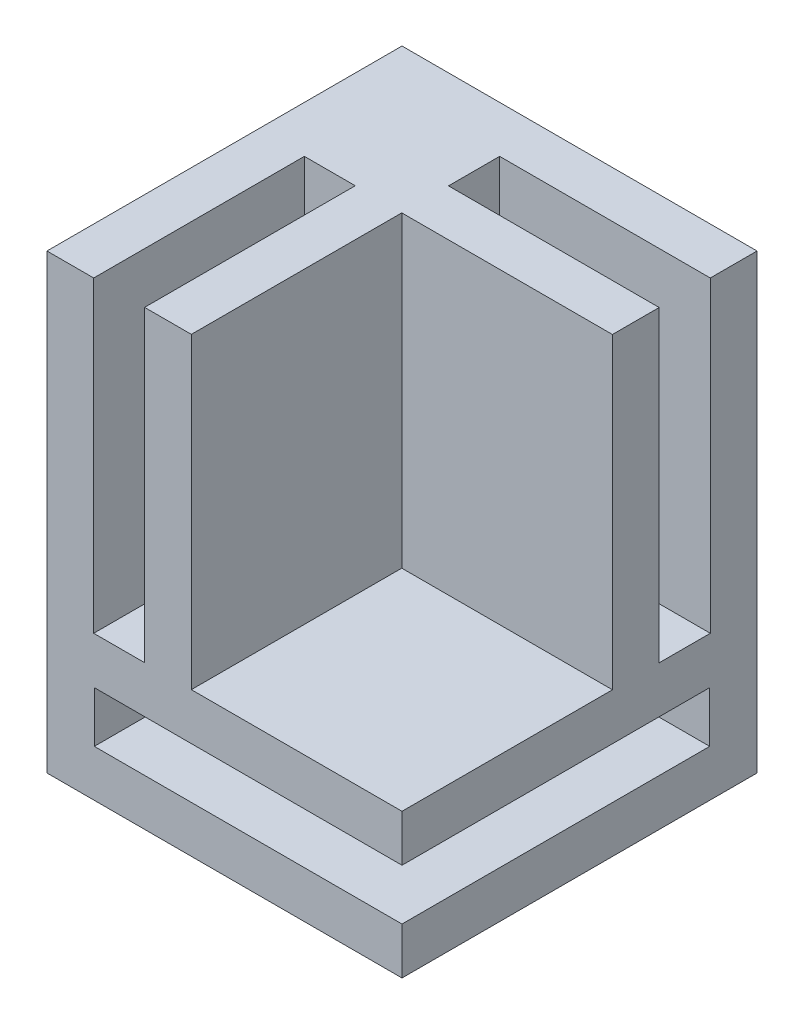
ISO-10303-21;
HEADER;
FILE_DESCRIPTION(('STEP AP214'),'2;1');
FILE_NAME('part.step','',(''),(''),'','','');
FILE_SCHEMA(('AUTOMOTIVE_DESIGN { 1 0 10303 214 1 1 1 1 }'));
ENDSEC;
DATA;
#1=APPLICATION_CONTEXT('core data for automotive mechanical design processes');
#2=APPLICATION_PROTOCOL_DEFINITION('international standard','automotive_design',2000,#1);
#3=PRODUCT_CONTEXT('',#1,'mechanical');
#4=PRODUCT('Part','Part','',(#3));
#5=PRODUCT_RELATED_PRODUCT_CATEGORY('part','',(#4));
#6=PRODUCT_DEFINITION_FORMATION('','',#4);
#7=PRODUCT_DEFINITION_CONTEXT('part definition',#1,'design');
#8=PRODUCT_DEFINITION('design','',#6,#7);
#9=PRODUCT_DEFINITION_SHAPE('','',#8);
#10=(LENGTH_UNIT() NAMED_UNIT(*) SI_UNIT(.MILLI.,.METRE.));
#11=(NAMED_UNIT(*) PLANE_ANGLE_UNIT() SI_UNIT($,.RADIAN.));
#12=(NAMED_UNIT(*) SI_UNIT($,.STERADIAN.) SOLID_ANGLE_UNIT());
#13=UNCERTAINTY_MEASURE_WITH_UNIT(LENGTH_MEASURE(1.E-05),#10,'distance_accuracy_value','');
#14=(GEOMETRIC_REPRESENTATION_CONTEXT(3) GLOBAL_UNCERTAINTY_ASSIGNED_CONTEXT((#13)) GLOBAL_UNIT_ASSIGNED_CONTEXT((#10,
#11,#12)) REPRESENTATION_CONTEXT('',''));
#15=CARTESIAN_POINT('',(0.,0.,0.));
#16=DIRECTION('',(0.,0.,1.));
#17=DIRECTION('',(1.,0.,0.));
#18=AXIS2_PLACEMENT_3D('',#15,#16,#17);
#19=CARTESIAN_POINT('',(-41.2499296580443,24.2977528089888,30.));
#20=DIRECTION('',(1.,0.,0.));
#21=DIRECTION('',(0.,0.,-1.));
#22=AXIS2_PLACEMENT_3D('',#19,#20,#21);
#23=PLANE('',#22);
#24=DIRECTION('',(0.,-1.,0.));
#25=VECTOR('',#24,1.);
#26=CARTESIAN_POINT('',(-41.2499296580443,24.2977528089888,0.));
#27=LINE('',#26,#25);
#28=CARTESIAN_POINT('',(-41.2499296580443,50.2977528089888,0.));
#29=VERTEX_POINT('',#28);
#30=CARTESIAN_POINT('',(-41.2499296580443,12.0977528089888,0.));
#31=VERTEX_POINT('',#30);
#32=EDGE_CURVE('E293',#29,#31,#27,.T.);
#33=ORIENTED_EDGE('',*,*,#32,.T.);
#34=DIRECTION('',(0.,0.,-1.));
#35=VECTOR('',#34,1.);
#36=CARTESIAN_POINT('',(-41.2499296580443,12.0977528089888,30.));
#37=LINE('',#36,#35);
#38=CARTESIAN_POINT('',(-41.2499296580443,12.0977528089888,30.));
#39=VERTEX_POINT('',#38);
#40=EDGE_CURVE('E11',#39,#31,#37,.T.);
#41=ORIENTED_EDGE('',*,*,#40,.F.);
#42=DIRECTION('',(0.,-1.,0.));
#43=VECTOR('',#42,1.);
#44=CARTESIAN_POINT('',(-41.2499296580443,24.2977528089888,30.));
#45=LINE('',#44,#43);
#46=CARTESIAN_POINT('',(-41.2499296580443,50.2977528089888,30.));
#47=VERTEX_POINT('',#46);
#48=EDGE_CURVE('E299',#47,#39,#45,.T.);
#49=ORIENTED_EDGE('',*,*,#48,.F.);
#50=DIRECTION('',(0.,0.,1.));
#51=VECTOR('',#50,1.);
#52=CARTESIAN_POINT('',(-41.2499296580443,50.2977528089888,0.));
#53=LINE('',#52,#51);
#54=EDGE_CURVE('E253',#29,#47,#53,.T.);
#55=ORIENTED_EDGE('',*,*,#54,.F.);
#56=EDGE_LOOP('',(#33,#41,#49,#55));
#57=FACE_BOUND('',#56,.T.);
#58=ADVANCED_FACE('F40',(#57),#23,.F.);
#59=CARTESIAN_POINT('',(-41.2499296580443,12.0977528089888,30.));
#60=DIRECTION('',(0.,1.,0.));
#61=DIRECTION('',(0.,0.,1.));
#62=AXIS2_PLACEMENT_3D('',#59,#60,#61);
#63=PLANE('',#62);
#64=DIRECTION('',(1.,0.,0.));
#65=VECTOR('',#64,1.);
#66=CARTESIAN_POINT('',(-41.2499296580443,12.0977528089888,0.));
#67=LINE('',#66,#65);
#68=CARTESIAN_POINT('',(-11.2499296580443,12.0977528089888,0.));
#69=VERTEX_POINT('',#68);
#70=EDGE_CURVE('E311',#31,#69,#67,.T.);
#71=ORIENTED_EDGE('',*,*,#70,.T.);
#72=DIRECTION('',(0.,0.,-1.));
#73=VECTOR('',#72,1.);
#74=CARTESIAN_POINT('',(-11.2499296580443,12.0977528089888,30.));
#75=LINE('',#74,#73);
#76=CARTESIAN_POINT('',(-11.2499296580443,12.0977528089888,30.));
#77=VERTEX_POINT('',#76);
#78=EDGE_CURVE('E47',#77,#69,#75,.T.);
#79=ORIENTED_EDGE('',*,*,#78,.F.);
#80=DIRECTION('',(1.,0.,0.));
#81=VECTOR('',#80,1.);
#82=CARTESIAN_POINT('',(-41.2499296580443,12.0977528089888,30.));
#83=LINE('',#82,#81);
#84=EDGE_CURVE('E302',#39,#77,#83,.T.);
#85=ORIENTED_EDGE('',*,*,#84,.F.);
#86=ORIENTED_EDGE('',*,*,#40,.T.);
#87=EDGE_LOOP('',(#71,#79,#85,#86));
#88=FACE_BOUND('',#87,.T.);
#89=ADVANCED_FACE('F374',(#88),#63,.F.);
#90=CARTESIAN_POINT('',(-11.2499296580443,24.2977528089888,30.));
#91=DIRECTION('',(-1.,0.,0.));
#92=DIRECTION('',(0.,0.,1.));
#93=AXIS2_PLACEMENT_3D('',#90,#91,#92);
#94=PLANE('',#93);
#95=DIRECTION('',(0.,0.,-1.));
#96=VECTOR('',#95,1.);
#97=CARTESIAN_POINT('',(-11.2499296580443,24.2977528089888,8.27));
#98=LINE('',#97,#96);
#99=CARTESIAN_POINT('',(-11.2499296580443,24.2977528089888,8.27));
#100=VERTEX_POINT('',#99);
#101=CARTESIAN_POINT('',(-11.2499296580443,24.2977528089888,3.94999999999999));
#102=VERTEX_POINT('',#101);
#103=EDGE_CURVE('E220',#100,#102,#98,.T.);
#104=ORIENTED_EDGE('',*,*,#103,.F.);
#105=DIRECTION('',(0.,-1.,0.));
#106=VECTOR('',#105,1.);
#107=CARTESIAN_POINT('',(-11.2499296580443,50.2977528089888,8.27));
#108=LINE('',#107,#106);
#109=CARTESIAN_POINT('',(-11.2499296580443,50.2977528089888,8.27));
#110=VERTEX_POINT('',#109);
#111=EDGE_CURVE('E203',#110,#100,#108,.T.);
#112=ORIENTED_EDGE('',*,*,#111,.F.);
#113=DIRECTION('',(0.,0.,-1.));
#114=VECTOR('',#113,1.);
#115=CARTESIAN_POINT('',(-11.2499296580443,50.2977528089888,0.));
#116=LINE('',#115,#114);
#117=CARTESIAN_POINT('',(-11.2499296580443,50.2977528089888,12.22));
#118=VERTEX_POINT('',#117);
#119=EDGE_CURVE('E264',#118,#110,#116,.T.);
#120=ORIENTED_EDGE('',*,*,#119,.F.);
#121=DIRECTION('',(0.,1.,0.));
#122=VECTOR('',#121,1.);
#123=CARTESIAN_POINT('',(-11.2499296580443,24.2977528089888,12.22));
#124=LINE('',#123,#122);
#125=CARTESIAN_POINT('',(-11.2499296580443,24.2977528089888,12.22));
#126=VERTEX_POINT('',#125);
#127=EDGE_CURVE('E245',#126,#118,#124,.T.);
#128=ORIENTED_EDGE('',*,*,#127,.F.);
#129=DIRECTION('',(0.,0.,-1.));
#130=VECTOR('',#129,1.);
#131=CARTESIAN_POINT('',(-11.2499296580443,24.2977528089888,30.));
#132=LINE('',#131,#130);
#133=CARTESIAN_POINT('',(-11.2499296580443,24.2977528089888,30.));
#134=VERTEX_POINT('',#133);
#135=EDGE_CURVE('E233',#134,#126,#132,.T.);
#136=ORIENTED_EDGE('',*,*,#135,.F.);
#137=DIRECTION('',(0.,1.,0.));
#138=VECTOR('',#137,1.);
#139=CARTESIAN_POINT('',(-11.2499296580443,24.2977528089888,30.));
#140=LINE('',#139,#138);
#141=CARTESIAN_POINT('',(-11.2499296580443,20.3477528089888,30.));
#142=VERTEX_POINT('',#141);
#143=EDGE_CURVE('E305',#142,#134,#140,.T.);
#144=ORIENTED_EDGE('',*,*,#143,.F.);
#145=DIRECTION('',(0.,0.,1.));
#146=VECTOR('',#145,1.);
#147=CARTESIAN_POINT('',(-11.2499296580443,20.3477528089888,30.));
#148=LINE('',#147,#146);
#149=CARTESIAN_POINT('',(-11.2499296580443,20.3477528089888,4.));
#150=VERTEX_POINT('',#149);
#151=EDGE_CURVE('E275',#150,#142,#148,.T.);
#152=ORIENTED_EDGE('',*,*,#151,.F.);
#153=DIRECTION('',(0.,1.,0.));
#154=VECTOR('',#153,1.);
#155=CARTESIAN_POINT('',(-11.2499296580443,20.3477528089888,4.));
#156=LINE('',#155,#154);
#157=CARTESIAN_POINT('',(-11.2499296580443,16.0477528089888,4.));
#158=VERTEX_POINT('',#157);
#159=EDGE_CURVE('E286',#158,#150,#156,.T.);
#160=ORIENTED_EDGE('',*,*,#159,.F.);
#161=DIRECTION('',(0.,0.,-1.));
#162=VECTOR('',#161,1.);
#163=CARTESIAN_POINT('',(-11.2499296580443,16.0477528089888,30.));
#164=LINE('',#163,#162);
#165=CARTESIAN_POINT('',(-11.2499296580443,16.0477528089888,30.));
#166=VERTEX_POINT('',#165);
#167=EDGE_CURVE('E270',#166,#158,#164,.T.);
#168=ORIENTED_EDGE('',*,*,#167,.F.);
#169=EDGE_CURVE('E306',#77,#166,#140,.T.);
#170=ORIENTED_EDGE('',*,*,#169,.F.);
#171=ORIENTED_EDGE('',*,*,#78,.T.);
#172=DIRECTION('',(0.,1.,0.));
#173=VECTOR('',#172,1.);
#174=CARTESIAN_POINT('',(-11.2499296580443,24.2977528089888,0.));
#175=LINE('',#174,#173);
#176=CARTESIAN_POINT('',(-11.2499296580443,50.2977528089888,0.));
#177=VERTEX_POINT('',#176);
#178=EDGE_CURVE('E303',#69,#177,#175,.T.);
#179=ORIENTED_EDGE('',*,*,#178,.T.);
#180=CARTESIAN_POINT('',(-11.2499296580443,50.2977528089888,3.95));
#181=VERTEX_POINT('',#180);
#182=EDGE_CURVE('E263',#181,#177,#116,.T.);
#183=ORIENTED_EDGE('',*,*,#182,.F.);
#184=DIRECTION('',(0.,1.,0.));
#185=VECTOR('',#184,1.);
#186=CARTESIAN_POINT('',(-11.2499296580443,50.2977528089888,3.95));
#187=LINE('',#186,#185);
#188=EDGE_CURVE('E212',#102,#181,#187,.T.);
#189=ORIENTED_EDGE('',*,*,#188,.F.);
#190=EDGE_LOOP('',(#104,#112,#120,#128,#136,#144,#152,#160,#168,#170,#171,#179,#183,#189));
#191=FACE_BOUND('',#190,.T.);
#192=ADVANCED_FACE('F320',(#191),#94,.F.);
#193=CARTESIAN_POINT('',(0.,0.,30.));
#194=DIRECTION('',(0.,0.,1.));
#195=DIRECTION('',(1.,0.,0.));
#196=AXIS2_PLACEMENT_3D('',#193,#194,#195);
#197=PLANE('',#196);
#198=DIRECTION('',(0.,-1.,0.));
#199=VECTOR('',#198,1.);
#200=CARTESIAN_POINT('',(-37.2999296580443,50.2977528089888,30.));
#201=LINE('',#200,#199);
#202=CARTESIAN_POINT('',(-37.2999296580443,50.2977528089888,30.));
#203=VERTEX_POINT('',#202);
#204=CARTESIAN_POINT('',(-37.2999296580443,24.2977528089888,30.));
#205=VERTEX_POINT('',#204);
#206=EDGE_CURVE('E179',#203,#205,#201,.T.);
#207=ORIENTED_EDGE('',*,*,#206,.F.);
#208=DIRECTION('',(1.,0.,0.));
#209=VECTOR('',#208,1.);
#210=CARTESIAN_POINT('',(-41.2499296580443,50.2977528089888,30.));
#211=LINE('',#210,#209);
#212=EDGE_CURVE('E260',#47,#203,#211,.T.);
#213=ORIENTED_EDGE('',*,*,#212,.F.);
#214=ORIENTED_EDGE('',*,*,#48,.T.);
#215=ORIENTED_EDGE('',*,*,#84,.T.);
#216=ORIENTED_EDGE('',*,*,#169,.T.);
#217=DIRECTION('',(1.,0.,0.));
#218=VECTOR('',#217,1.);
#219=CARTESIAN_POINT('',(-37.2499296580443,16.0477528089888,30.));
#220=LINE('',#219,#218);
#221=CARTESIAN_POINT('',(-37.2499296580443,16.0477528089888,30.));
#222=VERTEX_POINT('',#221);
#223=EDGE_CURVE('E283',#222,#166,#220,.T.);
#224=ORIENTED_EDGE('',*,*,#223,.F.);
#225=DIRECTION('',(0.,-1.,0.));
#226=VECTOR('',#225,1.);
#227=CARTESIAN_POINT('',(-37.2499296580443,20.3477528089888,30.));
#228=LINE('',#227,#226);
#229=CARTESIAN_POINT('',(-37.2499296580443,20.3477528089888,30.));
#230=VERTEX_POINT('',#229);
#231=EDGE_CURVE('E271',#230,#222,#228,.T.);
#232=ORIENTED_EDGE('',*,*,#231,.F.);
#233=DIRECTION('',(1.,0.,0.));
#234=VECTOR('',#233,1.);
#235=CARTESIAN_POINT('',(-37.2499296580443,20.3477528089888,30.));
#236=LINE('',#235,#234);
#237=EDGE_CURVE('E290',#230,#142,#236,.T.);
#238=ORIENTED_EDGE('',*,*,#237,.T.);
#239=ORIENTED_EDGE('',*,*,#143,.T.);
#240=DIRECTION('',(1.,0.,0.));
#241=VECTOR('',#240,1.);
#242=CARTESIAN_POINT('',(-11.2499296580443,24.2977528089888,30.));
#243=LINE('',#242,#241);
#244=CARTESIAN_POINT('',(-29.0499296580443,24.2977528089888,30.));
#245=VERTEX_POINT('',#244);
#246=EDGE_CURVE('E243',#245,#134,#243,.T.);
#247=ORIENTED_EDGE('',*,*,#246,.F.);
#248=DIRECTION('',(0.,1.,0.));
#249=VECTOR('',#248,1.);
#250=CARTESIAN_POINT('',(-29.0499296580443,24.2977528089888,30.));
#251=LINE('',#250,#249);
#252=CARTESIAN_POINT('',(-29.0499296580443,50.2977528089888,30.));
#253=VERTEX_POINT('',#252);
#254=EDGE_CURVE('E250',#245,#253,#251,.T.);
#255=ORIENTED_EDGE('',*,*,#254,.T.);
#256=CARTESIAN_POINT('',(-32.9999296580443,50.2977528089888,30.));
#257=VERTEX_POINT('',#256);
#258=EDGE_CURVE('E259',#257,#253,#211,.T.);
#259=ORIENTED_EDGE('',*,*,#258,.F.);
#260=DIRECTION('',(0.,1.,0.));
#261=VECTOR('',#260,1.);
#262=CARTESIAN_POINT('',(-32.9999296580443,50.2977528089888,30.));
#263=LINE('',#262,#261);
#264=CARTESIAN_POINT('',(-32.9999296580443,24.2977528089888,30.));
#265=VERTEX_POINT('',#264);
#266=EDGE_CURVE('E192',#265,#257,#263,.T.);
#267=ORIENTED_EDGE('',*,*,#266,.F.);
#268=DIRECTION('',(1.,0.,0.));
#269=VECTOR('',#268,1.);
#270=CARTESIAN_POINT('',(-37.2999296580443,24.2977528089888,30.));
#271=LINE('',#270,#269);
#272=EDGE_CURVE('E194',#205,#265,#271,.T.);
#273=ORIENTED_EDGE('',*,*,#272,.F.);
#274=EDGE_LOOP('',(#207,#213,#214,#215,#216,#224,#232,#238,#239,#247,#255,#259,#267,#273));
#275=FACE_BOUND('',#274,.T.);
#276=ADVANCED_FACE('F334',(#275),#197,.T.);
#277=CARTESIAN_POINT('',(0.,0.,0.));
#278=DIRECTION('',(0.,0.,1.));
#279=DIRECTION('',(1.,0.,0.));
#280=AXIS2_PLACEMENT_3D('',#277,#278,#279);
#281=PLANE('',#280);
#282=ORIENTED_EDGE('',*,*,#32,.F.);
#283=DIRECTION('',(-1.,0.,0.));
#284=VECTOR('',#283,1.);
#285=CARTESIAN_POINT('',(-41.2499296580443,50.2977528089888,0.));
#286=LINE('',#285,#284);
#287=EDGE_CURVE('E267',#177,#29,#286,.T.);
#288=ORIENTED_EDGE('',*,*,#287,.F.);
#289=ORIENTED_EDGE('',*,*,#178,.F.);
#290=ORIENTED_EDGE('',*,*,#70,.F.);
#291=EDGE_LOOP('',(#282,#288,#289,#290));
#292=FACE_BOUND('',#291,.T.);
#293=ADVANCED_FACE('F326',(#292),#281,.F.);
#294=CARTESIAN_POINT('',(-37.2499296580443,20.3477528089888,30.));
#295=DIRECTION('',(0.,1.,0.));
#296=DIRECTION('',(0.,0.,1.));
#297=AXIS2_PLACEMENT_3D('',#294,#295,#296);
#298=PLANE('',#297);
#299=ORIENTED_EDGE('',*,*,#151,.T.);
#300=ORIENTED_EDGE('',*,*,#237,.F.);
#301=DIRECTION('',(0.,0.,1.));
#302=VECTOR('',#301,1.);
#303=CARTESIAN_POINT('',(-37.2499296580443,20.3477528089888,30.));
#304=LINE('',#303,#302);
#305=CARTESIAN_POINT('',(-37.2499296580443,20.3477528089888,4.));
#306=VERTEX_POINT('',#305);
#307=EDGE_CURVE('E281',#306,#230,#304,.T.);
#308=ORIENTED_EDGE('',*,*,#307,.F.);
#309=DIRECTION('',(1.,0.,0.));
#310=VECTOR('',#309,1.);
#311=CARTESIAN_POINT('',(-37.2499296580443,20.3477528089888,4.));
#312=LINE('',#311,#310);
#313=EDGE_CURVE('E294',#306,#150,#312,.T.);
#314=ORIENTED_EDGE('',*,*,#313,.T.);
#315=EDGE_LOOP('',(#299,#300,#308,#314));
#316=FACE_BOUND('',#315,.T.);
#317=ADVANCED_FACE('F385',(#316),#298,.F.);
#318=CARTESIAN_POINT('',(-37.2499296580443,20.3477528089888,4.));
#319=DIRECTION('',(0.,0.,-1.));
#320=DIRECTION('',(-1.,0.,0.));
#321=AXIS2_PLACEMENT_3D('',#318,#319,#320);
#322=PLANE('',#321);
#323=ORIENTED_EDGE('',*,*,#159,.T.);
#324=ORIENTED_EDGE('',*,*,#313,.F.);
#325=DIRECTION('',(0.,1.,0.));
#326=VECTOR('',#325,1.);
#327=CARTESIAN_POINT('',(-37.2499296580443,20.3477528089888,4.));
#328=LINE('',#327,#326);
#329=CARTESIAN_POINT('',(-37.2499296580443,16.0477528089888,4.));
#330=VERTEX_POINT('',#329);
#331=EDGE_CURVE('E278',#330,#306,#328,.T.);
#332=ORIENTED_EDGE('',*,*,#331,.F.);
#333=DIRECTION('',(1.,0.,0.));
#334=VECTOR('',#333,1.);
#335=CARTESIAN_POINT('',(-37.2499296580443,16.0477528089888,4.));
#336=LINE('',#335,#334);
#337=EDGE_CURVE('E296',#330,#158,#336,.T.);
#338=ORIENTED_EDGE('',*,*,#337,.T.);
#339=EDGE_LOOP('',(#323,#324,#332,#338));
#340=FACE_BOUND('',#339,.T.);
#341=ADVANCED_FACE('F392',(#340),#322,.F.);
#342=CARTESIAN_POINT('',(-37.2499296580443,16.0477528089888,30.));
#343=DIRECTION('',(0.,-1.,0.));
#344=DIRECTION('',(0.,0.,-1.));
#345=AXIS2_PLACEMENT_3D('',#342,#343,#344);
#346=PLANE('',#345);
#347=ORIENTED_EDGE('',*,*,#167,.T.);
#348=ORIENTED_EDGE('',*,*,#337,.F.);
#349=DIRECTION('',(0.,0.,-1.));
#350=VECTOR('',#349,1.);
#351=CARTESIAN_POINT('',(-37.2499296580443,16.0477528089888,30.));
#352=LINE('',#351,#350);
#353=EDGE_CURVE('E274',#222,#330,#352,.T.);
#354=ORIENTED_EDGE('',*,*,#353,.F.);
#355=ORIENTED_EDGE('',*,*,#223,.T.);
#356=EDGE_LOOP('',(#347,#348,#354,#355));
#357=FACE_BOUND('',#356,.T.);
#358=ADVANCED_FACE('F388',(#357),#346,.F.);
#359=CARTESIAN_POINT('',(-37.2499296580443,0.,0.));
#360=DIRECTION('',(1.,0.,0.));
#361=DIRECTION('',(0.,0.,-1.));
#362=AXIS2_PLACEMENT_3D('',#359,#360,#361);
#363=PLANE('',#362);
#364=ORIENTED_EDGE('',*,*,#231,.T.);
#365=ORIENTED_EDGE('',*,*,#353,.T.);
#366=ORIENTED_EDGE('',*,*,#331,.T.);
#367=ORIENTED_EDGE('',*,*,#307,.T.);
#368=EDGE_LOOP('',(#364,#365,#366,#367));
#369=FACE_BOUND('',#368,.T.);
#370=ADVANCED_FACE('F391',(#369),#363,.T.);
#371=CARTESIAN_POINT('',(0.,50.2977528089888,0.));
#372=DIRECTION('',(0.,1.,0.));
#373=DIRECTION('',(0.,0.,1.));
#374=AXIS2_PLACEMENT_3D('',#371,#372,#373);
#375=PLANE('',#374);
#376=DIRECTION('',(0.,0.,1.));
#377=VECTOR('',#376,1.);
#378=CARTESIAN_POINT('',(-37.2999296580443,50.2977528089888,12.2));
#379=LINE('',#378,#377);
#380=CARTESIAN_POINT('',(-37.2999296580443,50.2977528089888,12.2));
#381=VERTEX_POINT('',#380);
#382=EDGE_CURVE('E201',#381,#203,#379,.T.);
#383=ORIENTED_EDGE('',*,*,#382,.F.);
#384=DIRECTION('',(-1.,0.,0.));
#385=VECTOR('',#384,1.);
#386=CARTESIAN_POINT('',(-37.2999296580443,50.2977528089888,12.2));
#387=LINE('',#386,#385);
#388=CARTESIAN_POINT('',(-32.9999296580443,50.2977528089888,12.2));
#389=VERTEX_POINT('',#388);
#390=EDGE_CURVE('E184',#389,#381,#387,.T.);
#391=ORIENTED_EDGE('',*,*,#390,.F.);
#392=DIRECTION('',(0.,0.,1.));
#393=VECTOR('',#392,1.);
#394=CARTESIAN_POINT('',(-32.9999296580443,50.2977528089888,12.2));
#395=LINE('',#394,#393);
#396=EDGE_CURVE('E204',#389,#257,#395,.T.);
#397=ORIENTED_EDGE('',*,*,#396,.T.);
#398=ORIENTED_EDGE('',*,*,#258,.T.);
#399=DIRECTION('',(0.,0.,1.));
#400=VECTOR('',#399,1.);
#401=CARTESIAN_POINT('',(-29.0499296580443,50.2977528089888,30.));
#402=LINE('',#401,#400);
#403=CARTESIAN_POINT('',(-29.0499296580443,50.2977528089888,12.22));
#404=VERTEX_POINT('',#403);
#405=EDGE_CURVE('E237',#404,#253,#402,.T.);
#406=ORIENTED_EDGE('',*,*,#405,.F.);
#407=DIRECTION('',(-1.,0.,0.));
#408=VECTOR('',#407,1.);
#409=CARTESIAN_POINT('',(-11.2499296580443,50.2977528089888,12.22));
#410=LINE('',#409,#408);
#411=EDGE_CURVE('E226',#118,#404,#410,.T.);
#412=ORIENTED_EDGE('',*,*,#411,.F.);
#413=ORIENTED_EDGE('',*,*,#119,.T.);
#414=DIRECTION('',(1.,0.,0.));
#415=VECTOR('',#414,1.);
#416=CARTESIAN_POINT('',(-29.0499296580443,50.2977528089888,8.27));
#417=LINE('',#416,#415);
#418=CARTESIAN_POINT('',(-29.0499296580443,50.2977528089888,8.27));
#419=VERTEX_POINT('',#418);
#420=EDGE_CURVE('E224',#419,#110,#417,.T.);
#421=ORIENTED_EDGE('',*,*,#420,.F.);
#422=DIRECTION('',(0.,0.,1.));
#423=VECTOR('',#422,1.);
#424=CARTESIAN_POINT('',(-29.0499296580443,50.2977528089888,8.27));
#425=LINE('',#424,#423);
#426=CARTESIAN_POINT('',(-29.0499296580443,50.2977528089888,3.94999999999999));
#427=VERTEX_POINT('',#426);
#428=EDGE_CURVE('E215',#427,#419,#425,.T.);
#429=ORIENTED_EDGE('',*,*,#428,.F.);
#430=DIRECTION('',(1.,0.,0.));
#431=VECTOR('',#430,1.);
#432=CARTESIAN_POINT('',(-29.0499296580443,50.2977528089888,3.95));
#433=LINE('',#432,#431);
#434=EDGE_CURVE('E227',#427,#181,#433,.T.);
#435=ORIENTED_EDGE('',*,*,#434,.T.);
#436=ORIENTED_EDGE('',*,*,#182,.T.);
#437=ORIENTED_EDGE('',*,*,#287,.T.);
#438=ORIENTED_EDGE('',*,*,#54,.T.);
#439=ORIENTED_EDGE('',*,*,#212,.T.);
#440=EDGE_LOOP('',(#383,#391,#397,#398,#406,#412,#413,#421,#429,#435,#436,#437,#438,#439));
#441=FACE_BOUND('',#440,.T.);
#442=ADVANCED_FACE('F329',(#441),#375,.T.);
#443=CARTESIAN_POINT('',(-29.0499296580443,24.2977528089888,30.));
#444=DIRECTION('',(-1.,0.,0.));
#445=DIRECTION('',(0.,0.,1.));
#446=AXIS2_PLACEMENT_3D('',#443,#444,#445);
#447=PLANE('',#446);
#448=ORIENTED_EDGE('',*,*,#405,.T.);
#449=ORIENTED_EDGE('',*,*,#254,.F.);
#450=DIRECTION('',(0.,0.,1.));
#451=VECTOR('',#450,1.);
#452=CARTESIAN_POINT('',(-29.0499296580443,24.2977528089888,30.));
#453=LINE('',#452,#451);
#454=CARTESIAN_POINT('',(-29.0499296580443,24.2977528089888,12.22));
#455=VERTEX_POINT('',#454);
#456=EDGE_CURVE('E240',#455,#245,#453,.T.);
#457=ORIENTED_EDGE('',*,*,#456,.F.);
#458=DIRECTION('',(0.,1.,0.));
#459=VECTOR('',#458,1.);
#460=CARTESIAN_POINT('',(-29.0499296580443,24.2977528089888,12.22));
#461=LINE('',#460,#459);
#462=EDGE_CURVE('E254',#455,#404,#461,.T.);
#463=ORIENTED_EDGE('',*,*,#462,.T.);
#464=EDGE_LOOP('',(#448,#449,#457,#463));
#465=FACE_BOUND('',#464,.T.);
#466=ADVANCED_FACE('F343',(#465),#447,.F.);
#467=CARTESIAN_POINT('',(-11.2499296580443,24.2977528089888,12.22));
#468=DIRECTION('',(0.,0.,-1.));
#469=DIRECTION('',(-1.,0.,0.));
#470=AXIS2_PLACEMENT_3D('',#467,#468,#469);
#471=PLANE('',#470);
#472=ORIENTED_EDGE('',*,*,#411,.T.);
#473=ORIENTED_EDGE('',*,*,#462,.F.);
#474=DIRECTION('',(-1.,0.,0.));
#475=VECTOR('',#474,1.);
#476=CARTESIAN_POINT('',(-11.2499296580443,24.2977528089888,12.22));
#477=LINE('',#476,#475);
#478=EDGE_CURVE('E236',#126,#455,#477,.T.);
#479=ORIENTED_EDGE('',*,*,#478,.F.);
#480=ORIENTED_EDGE('',*,*,#127,.T.);
#481=EDGE_LOOP('',(#472,#473,#479,#480));
#482=FACE_BOUND('',#481,.T.);
#483=ADVANCED_FACE('F349',(#482),#471,.F.);
#484=CARTESIAN_POINT('',(0.,24.2977528089888,0.));
#485=DIRECTION('',(0.,1.,0.));
#486=DIRECTION('',(0.,0.,1.));
#487=AXIS2_PLACEMENT_3D('',#484,#485,#486);
#488=PLANE('',#487);
#489=ORIENTED_EDGE('',*,*,#135,.T.);
#490=ORIENTED_EDGE('',*,*,#478,.T.);
#491=ORIENTED_EDGE('',*,*,#456,.T.);
#492=ORIENTED_EDGE('',*,*,#246,.T.);
#493=EDGE_LOOP('',(#489,#490,#491,#492));
#494=FACE_BOUND('',#493,.T.);
#495=ADVANCED_FACE('F345',(#494),#488,.T.);
#496=CARTESIAN_POINT('',(-29.0499296580443,50.2977528089888,8.27));
#497=DIRECTION('',(0.,0.,1.));
#498=DIRECTION('',(0.,-1.,0.));
#499=AXIS2_PLACEMENT_3D('',#496,#497,#498);
#500=PLANE('',#499);
#501=ORIENTED_EDGE('',*,*,#111,.T.);
#502=DIRECTION('',(1.,0.,0.));
#503=VECTOR('',#502,1.);
#504=CARTESIAN_POINT('',(-29.0499296580443,24.2977528089888,8.27));
#505=LINE('',#504,#503);
#506=CARTESIAN_POINT('',(-29.0499296580443,24.2977528089888,8.27));
#507=VERTEX_POINT('',#506);
#508=EDGE_CURVE('E217',#507,#100,#505,.T.);
#509=ORIENTED_EDGE('',*,*,#508,.F.);
#510=DIRECTION('',(0.,-1.,0.));
#511=VECTOR('',#510,1.);
#512=CARTESIAN_POINT('',(-29.0499296580443,50.2977528089888,8.27));
#513=LINE('',#512,#511);
#514=EDGE_CURVE('E208',#419,#507,#513,.T.);
#515=ORIENTED_EDGE('',*,*,#514,.F.);
#516=ORIENTED_EDGE('',*,*,#420,.T.);
#517=EDGE_LOOP('',(#501,#509,#515,#516));
#518=FACE_BOUND('',#517,.T.);
#519=ADVANCED_FACE('F356',(#518),#500,.F.);
#520=CARTESIAN_POINT('',(-29.0499296580443,50.2977528089888,3.95));
#521=DIRECTION('',(0.,0.,-1.));
#522=DIRECTION('',(0.,1.,0.));
#523=AXIS2_PLACEMENT_3D('',#520,#521,#522);
#524=PLANE('',#523);
#525=ORIENTED_EDGE('',*,*,#188,.T.);
#526=ORIENTED_EDGE('',*,*,#434,.F.);
#527=DIRECTION('',(0.,1.,0.));
#528=VECTOR('',#527,1.);
#529=CARTESIAN_POINT('',(-29.0499296580443,50.2977528089888,3.95));
#530=LINE('',#529,#528);
#531=CARTESIAN_POINT('',(-29.0499296580443,24.2977528089888,3.94999999999999));
#532=VERTEX_POINT('',#531);
#533=EDGE_CURVE('E62',#532,#427,#530,.T.);
#534=ORIENTED_EDGE('',*,*,#533,.F.);
#535=DIRECTION('',(1.,0.,0.));
#536=VECTOR('',#535,1.);
#537=CARTESIAN_POINT('',(-29.0499296580443,24.2977528089888,3.94999999999999));
#538=LINE('',#537,#536);
#539=EDGE_CURVE('E230',#532,#102,#538,.T.);
#540=ORIENTED_EDGE('',*,*,#539,.T.);
#541=EDGE_LOOP('',(#525,#526,#534,#540));
#542=FACE_BOUND('',#541,.T.);
#543=ADVANCED_FACE('F363',(#542),#524,.F.);
#544=CARTESIAN_POINT('',(-29.0499296580443,24.2977528089888,8.27));
#545=DIRECTION('',(0.,-1.,0.));
#546=DIRECTION('',(0.,0.,-1.));
#547=AXIS2_PLACEMENT_3D('',#544,#545,#546);
#548=PLANE('',#547);
#549=ORIENTED_EDGE('',*,*,#103,.T.);
#550=ORIENTED_EDGE('',*,*,#539,.F.);
#551=DIRECTION('',(0.,0.,-1.));
#552=VECTOR('',#551,1.);
#553=CARTESIAN_POINT('',(-29.0499296580443,24.2977528089888,8.27));
#554=LINE('',#553,#552);
#555=EDGE_CURVE('E211',#507,#532,#554,.T.);
#556=ORIENTED_EDGE('',*,*,#555,.F.);
#557=ORIENTED_EDGE('',*,*,#508,.T.);
#558=EDGE_LOOP('',(#549,#550,#556,#557));
#559=FACE_BOUND('',#558,.T.);
#560=ADVANCED_FACE('F361',(#559),#548,.F.);
#561=CARTESIAN_POINT('',(-29.0499296580443,0.,0.));
#562=DIRECTION('',(1.,0.,0.));
#563=DIRECTION('',(0.,0.,-1.));
#564=AXIS2_PLACEMENT_3D('',#561,#562,#563);
#565=PLANE('',#564);
#566=ORIENTED_EDGE('',*,*,#514,.T.);
#567=ORIENTED_EDGE('',*,*,#555,.T.);
#568=ORIENTED_EDGE('',*,*,#533,.T.);
#569=ORIENTED_EDGE('',*,*,#428,.T.);
#570=EDGE_LOOP('',(#566,#567,#568,#569));
#571=FACE_BOUND('',#570,.T.);
#572=ADVANCED_FACE('F359',(#571),#565,.T.);
#573=CARTESIAN_POINT('',(-37.2999296580443,50.2977528089888,12.2));
#574=DIRECTION('',(-1.,0.,0.));
#575=DIRECTION('',(0.,0.,1.));
#576=AXIS2_PLACEMENT_3D('',#573,#574,#575);
#577=PLANE('',#576);
#578=ORIENTED_EDGE('',*,*,#206,.T.);
#579=DIRECTION('',(0.,0.,1.));
#580=VECTOR('',#579,1.);
#581=CARTESIAN_POINT('',(-37.2999296580443,24.2977528089888,12.2));
#582=LINE('',#581,#580);
#583=CARTESIAN_POINT('',(-37.2999296580443,24.2977528089888,12.2));
#584=VERTEX_POINT('',#583);
#585=EDGE_CURVE('E173',#584,#205,#582,.T.);
#586=ORIENTED_EDGE('',*,*,#585,.F.);
#587=DIRECTION('',(0.,-1.,0.));
#588=VECTOR('',#587,1.);
#589=CARTESIAN_POINT('',(-37.2999296580443,50.2977528089888,12.2));
#590=LINE('',#589,#588);
#591=EDGE_CURVE('E177',#381,#584,#590,.T.);
#592=ORIENTED_EDGE('',*,*,#591,.F.);
#593=ORIENTED_EDGE('',*,*,#382,.T.);
#594=EDGE_LOOP('',(#578,#586,#592,#593));
#595=FACE_BOUND('',#594,.T.);
#596=ADVANCED_FACE('F175',(#595),#577,.F.);
#597=CARTESIAN_POINT('',(-32.9999296580443,50.2977528089888,12.2));
#598=DIRECTION('',(1.,0.,0.));
#599=DIRECTION('',(0.,1.,0.));
#600=AXIS2_PLACEMENT_3D('',#597,#598,#599);
#601=PLANE('',#600);
#602=ORIENTED_EDGE('',*,*,#266,.T.);
#603=ORIENTED_EDGE('',*,*,#396,.F.);
#604=DIRECTION('',(0.,1.,0.));
#605=VECTOR('',#604,1.);
#606=CARTESIAN_POINT('',(-32.9999296580443,50.2977528089888,12.2));
#607=LINE('',#606,#605);
#608=CARTESIAN_POINT('',(-32.9999296580443,24.2977528089888,12.2));
#609=VERTEX_POINT('',#608);
#610=EDGE_CURVE('E54',#609,#389,#607,.T.);
#611=ORIENTED_EDGE('',*,*,#610,.F.);
#612=DIRECTION('',(0.,0.,1.));
#613=VECTOR('',#612,1.);
#614=CARTESIAN_POINT('',(-32.9999296580443,24.2977528089888,12.2));
#615=LINE('',#614,#613);
#616=EDGE_CURVE('E183',#609,#265,#615,.T.);
#617=ORIENTED_EDGE('',*,*,#616,.T.);
#618=EDGE_LOOP('',(#602,#603,#611,#617));
#619=FACE_BOUND('',#618,.T.);
#620=ADVANCED_FACE('F462',(#619),#601,.F.);
#621=CARTESIAN_POINT('',(-37.2999296580443,24.2977528089888,12.2));
#622=DIRECTION('',(0.,-1.,0.));
#623=DIRECTION('',(1.,0.,0.));
#624=AXIS2_PLACEMENT_3D('',#621,#622,#623);
#625=PLANE('',#624);
#626=ORIENTED_EDGE('',*,*,#272,.T.);
#627=ORIENTED_EDGE('',*,*,#616,.F.);
#628=DIRECTION('',(1.,0.,0.));
#629=VECTOR('',#628,1.);
#630=CARTESIAN_POINT('',(-37.2999296580443,24.2977528089888,12.2));
#631=LINE('',#630,#629);
#632=EDGE_CURVE('E186',#584,#609,#631,.T.);
#633=ORIENTED_EDGE('',*,*,#632,.F.);
#634=ORIENTED_EDGE('',*,*,#585,.T.);
#635=EDGE_LOOP('',(#626,#627,#633,#634));
#636=FACE_BOUND('',#635,.T.);
#637=ADVANCED_FACE('F187',(#636),#625,.F.);
#638=CARTESIAN_POINT('',(0.,0.,12.2));
#639=DIRECTION('',(0.,0.,1.));
#640=DIRECTION('',(1.,0.,0.));
#641=AXIS2_PLACEMENT_3D('',#638,#639,#640);
#642=PLANE('',#641);
#643=ORIENTED_EDGE('',*,*,#591,.T.);
#644=ORIENTED_EDGE('',*,*,#632,.T.);
#645=ORIENTED_EDGE('',*,*,#610,.T.);
#646=ORIENTED_EDGE('',*,*,#390,.T.);
#647=EDGE_LOOP('',(#643,#644,#645,#646));
#648=FACE_BOUND('',#647,.T.);
#649=ADVANCED_FACE('F189',(#648),#642,.T.);
#650=CLOSED_SHELL('',(#58,#89,#192,#276,#293,#317,#341,#358,#370,#442,#466,#483,#495,#519,#543,
#560,#572,#596,#620,#637,#649));
#651=MANIFOLD_SOLID_BREP('B2',#650);
#652=ADVANCED_BREP_SHAPE_REPRESENTATION('',(#18,#651),#14);
#653=SHAPE_DEFINITION_REPRESENTATION(#9,#652);
ENDSEC;
END-ISO-10303-21;
